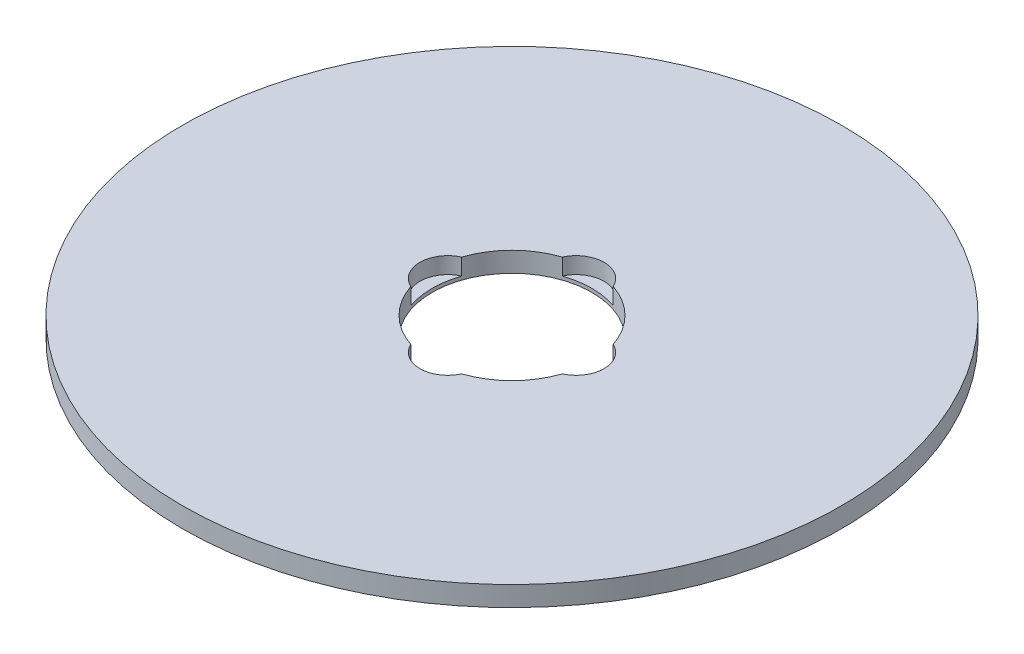
ISO-10303-21;
HEADER;
FILE_DESCRIPTION(('STEP AP214'),'2;1');
FILE_NAME('part.step','',(''),(''),'','','');
FILE_SCHEMA(('AUTOMOTIVE_DESIGN { 1 0 10303 214 1 1 1 1 }'));
ENDSEC;
DATA;
#1=APPLICATION_CONTEXT('core data for automotive mechanical design processes');
#2=APPLICATION_PROTOCOL_DEFINITION('international standard','automotive_design',2000,#1);
#3=PRODUCT_CONTEXT('',#1,'mechanical');
#4=PRODUCT('Part','Part','',(#3));
#5=PRODUCT_RELATED_PRODUCT_CATEGORY('part','',(#4));
#6=PRODUCT_DEFINITION_FORMATION('','',#4);
#7=PRODUCT_DEFINITION_CONTEXT('part definition',#1,'design');
#8=PRODUCT_DEFINITION('design','',#6,#7);
#9=PRODUCT_DEFINITION_SHAPE('','',#8);
#10=(LENGTH_UNIT() NAMED_UNIT(*) SI_UNIT(.MILLI.,.METRE.));
#11=(NAMED_UNIT(*) PLANE_ANGLE_UNIT() SI_UNIT($,.RADIAN.));
#12=(NAMED_UNIT(*) SI_UNIT($,.STERADIAN.) SOLID_ANGLE_UNIT());
#13=UNCERTAINTY_MEASURE_WITH_UNIT(LENGTH_MEASURE(1.E-05),#10,'distance_accuracy_value','');
#14=(GEOMETRIC_REPRESENTATION_CONTEXT(3) GLOBAL_UNCERTAINTY_ASSIGNED_CONTEXT((#13)) GLOBAL_UNIT_ASSIGNED_CONTEXT((#10,
#11,#12)) REPRESENTATION_CONTEXT('',''));
#15=CARTESIAN_POINT('',(0.,0.,0.));
#16=DIRECTION('',(0.,0.,1.));
#17=DIRECTION('',(1.,0.,0.));
#18=AXIS2_PLACEMENT_3D('',#15,#16,#17);
#19=CARTESIAN_POINT('',(0.,5.,0.));
#20=DIRECTION('',(0.,-1.,0.));
#21=DIRECTION('',(0.,0.,-1.));
#22=AXIS2_PLACEMENT_3D('',#19,#20,#21);
#23=CYLINDRICAL_SURFACE('',#22,82.5);
#24=CARTESIAN_POINT('',(0.,5.,0.));
#25=DIRECTION('',(0.,1.,0.));
#26=DIRECTION('',(0.,0.,1.));
#27=AXIS2_PLACEMENT_3D('',#24,#25,#26);
#28=CIRCLE('',#27,82.5);
#29=CARTESIAN_POINT('',(0.,5.,82.5));
#30=VERTEX_POINT('',#29);
#31=EDGE_CURVE('E148',#30,#30,#28,.T.);
#32=ORIENTED_EDGE('',*,*,#31,.F.);
#33=EDGE_LOOP('',(#32));
#34=FACE_BOUND('',#33,.T.);
#35=CARTESIAN_POINT('',(0.,0.,0.));
#36=DIRECTION('',(0.,1.,0.));
#37=DIRECTION('',(0.,0.,1.));
#38=AXIS2_PLACEMENT_3D('',#35,#36,#37);
#39=CIRCLE('',#38,82.5);
#40=CARTESIAN_POINT('',(0.,0.,82.5));
#41=VERTEX_POINT('',#40);
#42=EDGE_CURVE('E139',#41,#41,#39,.T.);
#43=ORIENTED_EDGE('',*,*,#42,.T.);
#44=EDGE_LOOP('',(#43));
#45=FACE_BOUND('',#44,.T.);
#46=ADVANCED_FACE('F39',(#34,#45),#23,.T.);
#47=CARTESIAN_POINT('',(0.,5.,0.));
#48=DIRECTION('',(0.,1.,0.));
#49=DIRECTION('',(0.,0.,1.));
#50=AXIS2_PLACEMENT_3D('',#47,#48,#49);
#51=PLANE('',#50);
#52=CARTESIAN_POINT('',(0.,5.,16.0440869092108));
#53=DIRECTION('',(0.,1.,0.));
#54=DIRECTION('',(1.,0.,0.));
#55=AXIS2_PLACEMENT_3D('',#52,#53,#54);
#56=CIRCLE('',#55,7.00811499052642);
#57=CARTESIAN_POINT('',(-6.37400742815489,5.,18.9571102572577));
#58=VERTEX_POINT('',#57);
#59=CARTESIAN_POINT('',(6.37400742815502,5.,18.9571102572577));
#60=VERTEX_POINT('',#59);
#61=EDGE_CURVE('E175',#58,#60,#56,.T.);
#62=ORIENTED_EDGE('',*,*,#61,.F.);
#63=CARTESIAN_POINT('',(0.,5.,0.));
#64=DIRECTION('',(0.,1.,0.));
#65=DIRECTION('',(0.,0.,1.));
#66=AXIS2_PLACEMENT_3D('',#63,#64,#65);
#67=CIRCLE('',#66,20.);
#68=CARTESIAN_POINT('',(-18.9571102572577,5.,6.37400742815495));
#69=VERTEX_POINT('',#68);
#70=EDGE_CURVE('E134',#69,#58,#67,.T.);
#71=ORIENTED_EDGE('',*,*,#70,.F.);
#72=CARTESIAN_POINT('',(-16.0440869092108,5.,0.));
#73=DIRECTION('',(0.,1.,0.));
#74=DIRECTION('',(0.,0.,1.));
#75=AXIS2_PLACEMENT_3D('',#72,#73,#74);
#76=CIRCLE('',#75,7.00811499052642);
#77=CARTESIAN_POINT('',(-18.9571102572577,5.,-6.37400742815495));
#78=VERTEX_POINT('',#77);
#79=EDGE_CURVE('E143',#78,#69,#76,.T.);
#80=ORIENTED_EDGE('',*,*,#79,.F.);
#81=CARTESIAN_POINT('',(-6.37400742815515,5.,-18.9571102572576));
#82=VERTEX_POINT('',#81);
#83=EDGE_CURVE('E123',#82,#78,#67,.T.);
#84=ORIENTED_EDGE('',*,*,#83,.F.);
#85=CARTESIAN_POINT('',(-1.68052890126861E-13,5.,-16.0440869092108));
#86=DIRECTION('',(0.,1.,0.));
#87=DIRECTION('',(-1.,0.,0.));
#88=AXIS2_PLACEMENT_3D('',#85,#86,#87);
#89=CIRCLE('',#88,7.00811499052642);
#90=CARTESIAN_POINT('',(6.37400742815475,5.,-18.9571102572578));
#91=VERTEX_POINT('',#90);
#92=EDGE_CURVE('E106',#91,#82,#89,.T.);
#93=ORIENTED_EDGE('',*,*,#92,.F.);
#94=CARTESIAN_POINT('',(18.9571102572577,5.,-6.37400742815495));
#95=VERTEX_POINT('',#94);
#96=EDGE_CURVE('E125',#95,#91,#67,.T.);
#97=ORIENTED_EDGE('',*,*,#96,.F.);
#98=CARTESIAN_POINT('',(16.0440869092108,5.,0.));
#99=DIRECTION('',(0.,1.,0.));
#100=DIRECTION('',(0.,0.,-1.));
#101=AXIS2_PLACEMENT_3D('',#98,#99,#100);
#102=CIRCLE('',#101,7.00811499052642);
#103=CARTESIAN_POINT('',(18.9571102572577,5.,6.37400742815495));
#104=VERTEX_POINT('',#103);
#105=EDGE_CURVE('E286',#104,#95,#102,.T.);
#106=ORIENTED_EDGE('',*,*,#105,.F.);
#107=EDGE_CURVE('E135',#60,#104,#67,.T.);
#108=ORIENTED_EDGE('',*,*,#107,.F.);
#109=EDGE_LOOP('',(#62,#71,#80,#84,#93,#97,#106,#108));
#110=FACE_BOUND('',#109,.T.);
#111=ORIENTED_EDGE('',*,*,#31,.T.);
#112=EDGE_LOOP('',(#111));
#113=FACE_BOUND('',#112,.T.);
#114=ADVANCED_FACE('F118',(#110,#113),#51,.T.);
#115=CARTESIAN_POINT('',(0.,0.,0.));
#116=DIRECTION('',(0.,1.,0.));
#117=DIRECTION('',(0.,0.,1.));
#118=AXIS2_PLACEMENT_3D('',#115,#116,#117);
#119=PLANE('',#118);
#120=CARTESIAN_POINT('',(0.,0.,0.));
#121=DIRECTION('',(0.,1.,0.));
#122=DIRECTION('',(0.,0.,1.));
#123=AXIS2_PLACEMENT_3D('',#120,#121,#122);
#124=CIRCLE('',#123,20.);
#125=CARTESIAN_POINT('',(0.,0.,20.));
#126=VERTEX_POINT('',#125);
#127=EDGE_CURVE('E136',#126,#126,#124,.T.);
#128=ORIENTED_EDGE('',*,*,#127,.T.);
#129=EDGE_LOOP('',(#128));
#130=FACE_BOUND('',#129,.T.);
#131=ORIENTED_EDGE('',*,*,#42,.F.);
#132=EDGE_LOOP('',(#131));
#133=FACE_BOUND('',#132,.T.);
#134=ADVANCED_FACE('F187',(#130,#133),#119,.F.);
#135=CARTESIAN_POINT('',(0.,5.,0.));
#136=DIRECTION('',(0.,-1.,0.));
#137=DIRECTION('',(0.,0.,-1.));
#138=AXIS2_PLACEMENT_3D('',#135,#136,#137);
#139=CYLINDRICAL_SURFACE('',#138,20.);
#140=DIRECTION('',(0.,1.,0.));
#141=VECTOR('',#140,1.);
#142=CARTESIAN_POINT('',(-6.37400742815488,2.94078941368842,18.9571102572577));
#143=LINE('',#142,#141);
#144=CARTESIAN_POINT('',(-6.37400742815489,0.881578827376831,18.9571102572577));
#145=VERTEX_POINT('',#144);
#146=EDGE_CURVE('E11',#145,#58,#143,.T.);
#147=ORIENTED_EDGE('',*,*,#146,.F.);
#148=CARTESIAN_POINT('',(0.,0.881578827376831,0.));
#149=DIRECTION('',(0.,1.,0.));
#150=DIRECTION('',(0.,0.,1.));
#151=AXIS2_PLACEMENT_3D('',#148,#149,#150);
#152=CIRCLE('',#151,20.);
#153=CARTESIAN_POINT('',(6.37400742815502,0.881578827376831,18.9571102572577));
#154=VERTEX_POINT('',#153);
#155=EDGE_CURVE('E170',#145,#154,#152,.T.);
#156=ORIENTED_EDGE('',*,*,#155,.T.);
#157=DIRECTION('',(0.,1.,0.));
#158=VECTOR('',#157,1.);
#159=CARTESIAN_POINT('',(6.37400742815502,2.94078941368842,18.9571102572577));
#160=LINE('',#159,#158);
#161=EDGE_CURVE('E46',#60,#154,#160,.F.);
#162=ORIENTED_EDGE('',*,*,#161,.F.);
#163=ORIENTED_EDGE('',*,*,#107,.T.);
#164=DIRECTION('',(0.,1.,0.));
#165=VECTOR('',#164,1.);
#166=CARTESIAN_POINT('',(18.9571102572577,2.94078941368842,6.37400742815495));
#167=LINE('',#166,#165);
#168=CARTESIAN_POINT('',(18.9571102572577,0.881578827376831,6.37400742815495));
#169=VERTEX_POINT('',#168);
#170=EDGE_CURVE('E164',#169,#104,#167,.T.);
#171=ORIENTED_EDGE('',*,*,#170,.F.);
#172=CARTESIAN_POINT('',(0.,0.881578827376831,0.));
#173=DIRECTION('',(0.,1.,0.));
#174=DIRECTION('',(0.,0.,1.));
#175=AXIS2_PLACEMENT_3D('',#172,#173,#174);
#176=CIRCLE('',#175,20.);
#177=CARTESIAN_POINT('',(18.9571102572577,0.881578827376831,-6.37400742815495));
#178=VERTEX_POINT('',#177);
#179=EDGE_CURVE('E115',#169,#178,#176,.T.);
#180=ORIENTED_EDGE('',*,*,#179,.T.);
#181=DIRECTION('',(0.,1.,0.));
#182=VECTOR('',#181,1.);
#183=CARTESIAN_POINT('',(18.9571102572577,2.94078941368842,-6.37400742815495));
#184=LINE('',#183,#182);
#185=EDGE_CURVE('E131',#95,#178,#184,.F.);
#186=ORIENTED_EDGE('',*,*,#185,.F.);
#187=ORIENTED_EDGE('',*,*,#96,.T.);
#188=DIRECTION('',(0.,1.,0.));
#189=VECTOR('',#188,1.);
#190=CARTESIAN_POINT('',(6.37400742815475,2.94078941368842,-18.9571102572578));
#191=LINE('',#190,#189);
#192=CARTESIAN_POINT('',(6.37400742815475,0.881578827376831,-18.9571102572578));
#193=VERTEX_POINT('',#192);
#194=EDGE_CURVE('E105',#193,#91,#191,.T.);
#195=ORIENTED_EDGE('',*,*,#194,.F.);
#196=CARTESIAN_POINT('',(0.,0.881578827376831,0.));
#197=DIRECTION('',(0.,1.,0.));
#198=DIRECTION('',(0.,0.,1.));
#199=AXIS2_PLACEMENT_3D('',#196,#197,#198);
#200=CIRCLE('',#199,20.);
#201=CARTESIAN_POINT('',(-6.37400742815515,0.881578827376831,-18.9571102572576));
#202=VERTEX_POINT('',#201);
#203=EDGE_CURVE('E159',#193,#202,#200,.T.);
#204=ORIENTED_EDGE('',*,*,#203,.T.);
#205=DIRECTION('',(0.,1.,0.));
#206=VECTOR('',#205,1.);
#207=CARTESIAN_POINT('',(-6.37400742815515,2.94078941368842,-18.9571102572577));
#208=LINE('',#207,#206);
#209=EDGE_CURVE('E114',#82,#202,#208,.F.);
#210=ORIENTED_EDGE('',*,*,#209,.F.);
#211=ORIENTED_EDGE('',*,*,#83,.T.);
#212=DIRECTION('',(0.,1.,0.));
#213=VECTOR('',#212,1.);
#214=CARTESIAN_POINT('',(-18.9571102572577,2.94078941368842,-6.37400742815495));
#215=LINE('',#214,#213);
#216=CARTESIAN_POINT('',(-18.9571102572577,0.881578827376831,-6.37400742815495));
#217=VERTEX_POINT('',#216);
#218=EDGE_CURVE('E160',#217,#78,#215,.T.);
#219=ORIENTED_EDGE('',*,*,#218,.F.);
#220=CARTESIAN_POINT('',(0.,0.881578827376831,0.));
#221=DIRECTION('',(0.,1.,0.));
#222=DIRECTION('',(0.,0.,1.));
#223=AXIS2_PLACEMENT_3D('',#220,#221,#222);
#224=CIRCLE('',#223,20.);
#225=CARTESIAN_POINT('',(-18.9571102572577,0.881578827376831,6.37400742815495));
#226=VERTEX_POINT('',#225);
#227=EDGE_CURVE('E149',#217,#226,#224,.T.);
#228=ORIENTED_EDGE('',*,*,#227,.T.);
#229=DIRECTION('',(0.,1.,0.));
#230=VECTOR('',#229,1.);
#231=CARTESIAN_POINT('',(-18.9571102572577,2.94078941368842,6.37400742815495));
#232=LINE('',#231,#230);
#233=EDGE_CURVE('E152',#69,#226,#232,.F.);
#234=ORIENTED_EDGE('',*,*,#233,.F.);
#235=ORIENTED_EDGE('',*,*,#70,.T.);
#236=EDGE_LOOP('',(#147,#156,#162,#163,#171,#180,#186,#187,#195,#204,#210,#211,#219,#228,#234,#235));
#237=FACE_BOUND('',#236,.T.);
#238=ORIENTED_EDGE('',*,*,#127,.F.);
#239=EDGE_LOOP('',(#238));
#240=FACE_BOUND('',#239,.T.);
#241=ADVANCED_FACE('F126',(#237,#240),#139,.F.);
#242=CARTESIAN_POINT('',(-16.0440869092108,0.881578827376831,0.));
#243=DIRECTION('',(0.,1.,0.));
#244=DIRECTION('',(0.,0.,1.));
#245=AXIS2_PLACEMENT_3D('',#242,#243,#244);
#246=CYLINDRICAL_SURFACE('',#245,7.00811499052642);
#247=ORIENTED_EDGE('',*,*,#218,.T.);
#248=ORIENTED_EDGE('',*,*,#79,.T.);
#249=ORIENTED_EDGE('',*,*,#233,.T.);
#250=CARTESIAN_POINT('',(-16.0440869092108,0.881578827376831,0.));
#251=DIRECTION('',(0.,1.,0.));
#252=DIRECTION('',(0.,0.,1.));
#253=AXIS2_PLACEMENT_3D('',#250,#251,#252);
#254=CIRCLE('',#253,7.00811499052642);
#255=EDGE_CURVE('E144',#217,#226,#254,.T.);
#256=ORIENTED_EDGE('',*,*,#255,.F.);
#257=EDGE_LOOP('',(#247,#248,#249,#256));
#258=FACE_BOUND('',#257,.T.);
#259=ADVANCED_FACE('F200',(#258),#246,.F.);
#260=CARTESIAN_POINT('',(-16.0440869092108,0.881578827376831,0.));
#261=DIRECTION('',(0.,1.,0.));
#262=DIRECTION('',(0.,0.,1.));
#263=AXIS2_PLACEMENT_3D('',#260,#261,#262);
#264=PLANE('',#263);
#265=ORIENTED_EDGE('',*,*,#255,.T.);
#266=ORIENTED_EDGE('',*,*,#227,.F.);
#267=EDGE_LOOP('',(#265,#266));
#268=FACE_BOUND('',#267,.T.);
#269=ADVANCED_FACE('F201',(#268),#264,.T.);
#270=CARTESIAN_POINT('',(-1.68052890126861E-13,0.881578827376831,-16.0440869092108));
#271=DIRECTION('',(0.,1.,0.));
#272=DIRECTION('',(0.,0.,1.));
#273=AXIS2_PLACEMENT_3D('',#270,#271,#272);
#274=CYLINDRICAL_SURFACE('',#273,7.00811499052642);
#275=ORIENTED_EDGE('',*,*,#194,.T.);
#276=ORIENTED_EDGE('',*,*,#92,.T.);
#277=ORIENTED_EDGE('',*,*,#209,.T.);
#278=CARTESIAN_POINT('',(-1.68052890126861E-13,0.881578827376831,-16.0440869092108));
#279=DIRECTION('',(0.,1.,0.));
#280=DIRECTION('',(-1.,0.,0.));
#281=AXIS2_PLACEMENT_3D('',#278,#279,#280);
#282=CIRCLE('',#281,7.00811499052642);
#283=EDGE_CURVE('E107',#193,#202,#282,.T.);
#284=ORIENTED_EDGE('',*,*,#283,.F.);
#285=EDGE_LOOP('',(#275,#276,#277,#284));
#286=FACE_BOUND('',#285,.T.);
#287=ADVANCED_FACE('F102',(#286),#274,.F.);
#288=CARTESIAN_POINT('',(-1.68052890126861E-13,0.881578827376831,-16.0440869092108));
#289=DIRECTION('',(0.,1.,0.));
#290=DIRECTION('',(-1.,0.,0.));
#291=AXIS2_PLACEMENT_3D('',#288,#289,#290);
#292=PLANE('',#291);
#293=ORIENTED_EDGE('',*,*,#283,.T.);
#294=ORIENTED_EDGE('',*,*,#203,.F.);
#295=EDGE_LOOP('',(#293,#294));
#296=FACE_BOUND('',#295,.T.);
#297=ADVANCED_FACE('F209',(#296),#292,.T.);
#298=CARTESIAN_POINT('',(16.0440869092108,0.881578827376831,0.));
#299=DIRECTION('',(0.,1.,0.));
#300=DIRECTION('',(0.,0.,1.));
#301=AXIS2_PLACEMENT_3D('',#298,#299,#300);
#302=CYLINDRICAL_SURFACE('',#301,7.00811499052642);
#303=ORIENTED_EDGE('',*,*,#170,.T.);
#304=ORIENTED_EDGE('',*,*,#105,.T.);
#305=ORIENTED_EDGE('',*,*,#185,.T.);
#306=CARTESIAN_POINT('',(16.0440869092108,0.881578827376831,0.));
#307=DIRECTION('',(0.,1.,0.));
#308=DIRECTION('',(0.,0.,-1.));
#309=AXIS2_PLACEMENT_3D('',#306,#307,#308);
#310=CIRCLE('',#309,7.00811499052642);
#311=EDGE_CURVE('E56',#169,#178,#310,.T.);
#312=ORIENTED_EDGE('',*,*,#311,.F.);
#313=EDGE_LOOP('',(#303,#304,#305,#312));
#314=FACE_BOUND('',#313,.T.);
#315=ADVANCED_FACE('F213',(#314),#302,.F.);
#316=CARTESIAN_POINT('',(16.0440869092108,0.881578827376831,0.));
#317=DIRECTION('',(0.,1.,0.));
#318=DIRECTION('',(0.,0.,-1.));
#319=AXIS2_PLACEMENT_3D('',#316,#317,#318);
#320=PLANE('',#319);
#321=ORIENTED_EDGE('',*,*,#311,.T.);
#322=ORIENTED_EDGE('',*,*,#179,.F.);
#323=EDGE_LOOP('',(#321,#322));
#324=FACE_BOUND('',#323,.T.);
#325=ADVANCED_FACE('F179',(#324),#320,.T.);
#326=CARTESIAN_POINT('',(0.,0.881578827376831,16.0440869092108));
#327=DIRECTION('',(0.,1.,0.));
#328=DIRECTION('',(0.,0.,1.));
#329=AXIS2_PLACEMENT_3D('',#326,#327,#328);
#330=CYLINDRICAL_SURFACE('',#329,7.00811499052642);
#331=ORIENTED_EDGE('',*,*,#146,.T.);
#332=ORIENTED_EDGE('',*,*,#61,.T.);
#333=ORIENTED_EDGE('',*,*,#161,.T.);
#334=CARTESIAN_POINT('',(0.,0.881578827376831,16.0440869092108));
#335=DIRECTION('',(0.,1.,0.));
#336=DIRECTION('',(1.,0.,0.));
#337=AXIS2_PLACEMENT_3D('',#334,#335,#336);
#338=CIRCLE('',#337,7.00811499052642);
#339=EDGE_CURVE('E55',#145,#154,#338,.T.);
#340=ORIENTED_EDGE('',*,*,#339,.F.);
#341=EDGE_LOOP('',(#331,#332,#333,#340));
#342=FACE_BOUND('',#341,.T.);
#343=ADVANCED_FACE('F171',(#342),#330,.F.);
#344=CARTESIAN_POINT('',(0.,0.881578827376831,16.0440869092108));
#345=DIRECTION('',(0.,1.,0.));
#346=DIRECTION('',(1.,0.,0.));
#347=AXIS2_PLACEMENT_3D('',#344,#345,#346);
#348=PLANE('',#347);
#349=ORIENTED_EDGE('',*,*,#339,.T.);
#350=ORIENTED_EDGE('',*,*,#155,.F.);
#351=EDGE_LOOP('',(#349,#350));
#352=FACE_BOUND('',#351,.T.);
#353=ADVANCED_FACE('F173',(#352),#348,.T.);
#354=CLOSED_SHELL('',(#46,#114,#134,#241,#259,#269,#287,#297,#315,#325,#343,#353));
#355=MANIFOLD_SOLID_BREP('B2',#354);
#356=ADVANCED_BREP_SHAPE_REPRESENTATION('',(#18,#355),#14);
#357=SHAPE_DEFINITION_REPRESENTATION(#9,#356);
ENDSEC;
END-ISO-10303-21;
